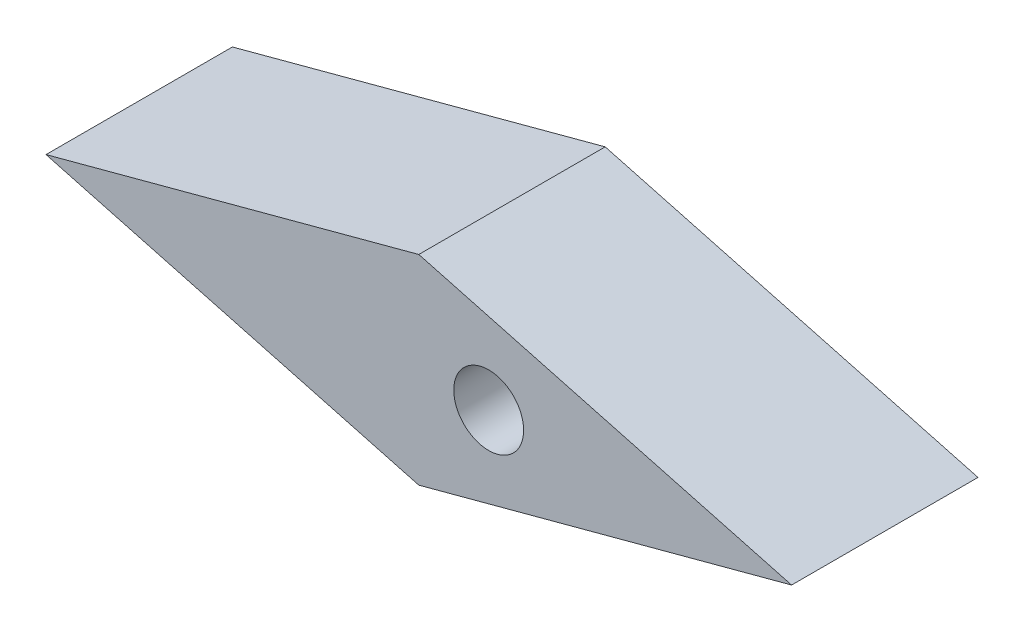
ISO-10303-21;
HEADER;
FILE_DESCRIPTION(('STEP AP214'),'2;1');
FILE_NAME('part.step','',(''),(''),'','','');
FILE_SCHEMA(('AUTOMOTIVE_DESIGN { 1 0 10303 214 1 1 1 1 }'));
ENDSEC;
DATA;
#1=APPLICATION_CONTEXT('core data for automotive mechanical design processes');
#2=APPLICATION_PROTOCOL_DEFINITION('international standard','automotive_design',2000,#1);
#3=PRODUCT_CONTEXT('',#1,'mechanical');
#4=PRODUCT('Part','Part','',(#3));
#5=PRODUCT_RELATED_PRODUCT_CATEGORY('part','',(#4));
#6=PRODUCT_DEFINITION_FORMATION('','',#4);
#7=PRODUCT_DEFINITION_CONTEXT('part definition',#1,'design');
#8=PRODUCT_DEFINITION('design','',#6,#7);
#9=PRODUCT_DEFINITION_SHAPE('','',#8);
#10=(LENGTH_UNIT() NAMED_UNIT(*) SI_UNIT(.MILLI.,.METRE.));
#11=(NAMED_UNIT(*) PLANE_ANGLE_UNIT() SI_UNIT($,.RADIAN.));
#12=(NAMED_UNIT(*) SI_UNIT($,.STERADIAN.) SOLID_ANGLE_UNIT());
#13=UNCERTAINTY_MEASURE_WITH_UNIT(LENGTH_MEASURE(1.E-05),#10,'distance_accuracy_value','');
#14=(GEOMETRIC_REPRESENTATION_CONTEXT(3) GLOBAL_UNCERTAINTY_ASSIGNED_CONTEXT((#13)) GLOBAL_UNIT_ASSIGNED_CONTEXT((#10,
#11,#12)) REPRESENTATION_CONTEXT('',''));
#15=CARTESIAN_POINT('',(0.,0.,0.));
#16=DIRECTION('',(0.,0.,1.));
#17=DIRECTION('',(1.,0.,0.));
#18=AXIS2_PLACEMENT_3D('',#15,#16,#17);
#19=CARTESIAN_POINT('',(3.,0.,8.));
#20=DIRECTION('',(0.,0.,-1.));
#21=DIRECTION('',(-1.,0.,0.));
#22=AXIS2_PLACEMENT_3D('',#19,#20,#21);
#23=CYLINDRICAL_SURFACE('',#22,1.5);
#24=CARTESIAN_POINT('',(3.,0.,8.));
#25=DIRECTION('',(0.,0.,-1.));
#26=DIRECTION('',(-1.,0.,0.));
#27=AXIS2_PLACEMENT_3D('',#24,#25,#26);
#28=CIRCLE('',#27,1.5);
#29=CARTESIAN_POINT('',(1.5,0.,8.));
#30=VERTEX_POINT('',#29);
#31=EDGE_CURVE('E105',#30,#30,#28,.T.);
#32=ORIENTED_EDGE('',*,*,#31,.F.);
#33=EDGE_LOOP('',(#32));
#34=FACE_BOUND('',#33,.T.);
#35=CARTESIAN_POINT('',(3.,0.,3.));
#36=DIRECTION('',(0.,0.,-1.));
#37=DIRECTION('',(-1.,0.,0.));
#38=AXIS2_PLACEMENT_3D('',#35,#36,#37);
#39=CIRCLE('',#38,1.5);
#40=CARTESIAN_POINT('',(1.5,0.,3.));
#41=VERTEX_POINT('',#40);
#42=EDGE_CURVE('E40',#41,#41,#39,.F.);
#43=ORIENTED_EDGE('',*,*,#42,.F.);
#44=EDGE_LOOP('',(#43));
#45=FACE_BOUND('',#44,.T.);
#46=ADVANCED_FACE('F36',(#34,#45),#23,.F.);
#47=CARTESIAN_POINT('',(0.,-4.28718707889784,8.));
#48=DIRECTION('',(0.258819045102514,0.96592582628907,0.));
#49=DIRECTION('',(-0.96592582628907,0.258819045102514,0.));
#50=AXIS2_PLACEMENT_3D('',#47,#48,#49);
#51=PLANE('',#50);
#52=DIRECTION('',(0.96592582628907,-0.258819045102514,0.));
#53=VECTOR('',#52,1.);
#54=CARTESIAN_POINT('',(0.,-4.28718707889784,0.));
#55=LINE('',#54,#53);
#56=CARTESIAN_POINT('',(-16.,0.,0.));
#57=VERTEX_POINT('',#56);
#58=CARTESIAN_POINT('',(0.,-4.28718707889784,0.));
#59=VERTEX_POINT('',#58);
#60=EDGE_CURVE('E102',#57,#59,#55,.T.);
#61=ORIENTED_EDGE('',*,*,#60,.T.);
#62=DIRECTION('',(0.,0.,-1.));
#63=VECTOR('',#62,1.);
#64=CARTESIAN_POINT('',(0.,-4.28718707889784,8.));
#65=LINE('',#64,#63);
#66=CARTESIAN_POINT('',(0.,-4.28718707889784,8.));
#67=VERTEX_POINT('',#66);
#68=EDGE_CURVE('E11',#67,#59,#65,.T.);
#69=ORIENTED_EDGE('',*,*,#68,.F.);
#70=DIRECTION('',(0.96592582628907,-0.258819045102514,0.));
#71=VECTOR('',#70,1.);
#72=CARTESIAN_POINT('',(0.,-4.28718707889784,8.));
#73=LINE('',#72,#71);
#74=CARTESIAN_POINT('',(-16.,0.,8.));
#75=VERTEX_POINT('',#74);
#76=EDGE_CURVE('E89',#75,#67,#73,.T.);
#77=ORIENTED_EDGE('',*,*,#76,.F.);
#78=DIRECTION('',(0.,0.,-1.));
#79=VECTOR('',#78,1.);
#80=CARTESIAN_POINT('',(-16.,0.,8.));
#81=LINE('',#80,#79);
#82=EDGE_CURVE('E98',#75,#57,#81,.T.);
#83=ORIENTED_EDGE('',*,*,#82,.T.);
#84=EDGE_LOOP('',(#61,#69,#77,#83));
#85=FACE_BOUND('',#84,.T.);
#86=ADVANCED_FACE('F38',(#85),#51,.F.);
#87=CARTESIAN_POINT('',(16.,0.,8.));
#88=DIRECTION('',(-0.258819045102514,0.96592582628907,0.));
#89=DIRECTION('',(-0.96592582628907,-0.258819045102514,0.));
#90=AXIS2_PLACEMENT_3D('',#87,#88,#89);
#91=PLANE('',#90);
#92=DIRECTION('',(0.96592582628907,0.258819045102514,0.));
#93=VECTOR('',#92,1.);
#94=CARTESIAN_POINT('',(16.,0.,0.));
#95=LINE('',#94,#93);
#96=CARTESIAN_POINT('',(16.,0.,0.));
#97=VERTEX_POINT('',#96);
#98=EDGE_CURVE('E93',#59,#97,#95,.T.);
#99=ORIENTED_EDGE('',*,*,#98,.T.);
#100=DIRECTION('',(0.,0.,-1.));
#101=VECTOR('',#100,1.);
#102=CARTESIAN_POINT('',(16.,0.,8.));
#103=LINE('',#102,#101);
#104=CARTESIAN_POINT('',(16.,0.,8.));
#105=VERTEX_POINT('',#104);
#106=EDGE_CURVE('E46',#105,#97,#103,.T.);
#107=ORIENTED_EDGE('',*,*,#106,.F.);
#108=DIRECTION('',(0.96592582628907,0.258819045102514,0.));
#109=VECTOR('',#108,1.);
#110=CARTESIAN_POINT('',(16.,0.,8.));
#111=LINE('',#110,#109);
#112=EDGE_CURVE('E84',#67,#105,#111,.T.);
#113=ORIENTED_EDGE('',*,*,#112,.F.);
#114=ORIENTED_EDGE('',*,*,#68,.T.);
#115=EDGE_LOOP('',(#99,#107,#113,#114));
#116=FACE_BOUND('',#115,.T.);
#117=ADVANCED_FACE('F92',(#116),#91,.F.);
#118=CARTESIAN_POINT('',(0.,4.28718707889798,8.));
#119=DIRECTION('',(-0.258819045102522,-0.965925826289068,0.));
#120=DIRECTION('',(0.965925826289068,-0.258819045102522,0.));
#121=AXIS2_PLACEMENT_3D('',#118,#119,#120);
#122=PLANE('',#121);
#123=DIRECTION('',(-0.965925826289068,0.258819045102522,0.));
#124=VECTOR('',#123,1.);
#125=CARTESIAN_POINT('',(0.,4.28718707889798,0.));
#126=LINE('',#125,#124);
#127=CARTESIAN_POINT('',(0.,4.28718707889798,0.));
#128=VERTEX_POINT('',#127);
#129=EDGE_CURVE('E71',#97,#128,#126,.T.);
#130=ORIENTED_EDGE('',*,*,#129,.T.);
#131=DIRECTION('',(0.,0.,-1.));
#132=VECTOR('',#131,1.);
#133=CARTESIAN_POINT('',(0.,4.28718707889798,8.));
#134=LINE('',#133,#132);
#135=CARTESIAN_POINT('',(0.,4.28718707889798,8.));
#136=VERTEX_POINT('',#135);
#137=EDGE_CURVE('E94',#136,#128,#134,.T.);
#138=ORIENTED_EDGE('',*,*,#137,.F.);
#139=DIRECTION('',(-0.965925826289068,0.258819045102522,0.));
#140=VECTOR('',#139,1.);
#141=CARTESIAN_POINT('',(0.,4.28718707889798,8.));
#142=LINE('',#141,#140);
#143=EDGE_CURVE('E87',#105,#136,#142,.T.);
#144=ORIENTED_EDGE('',*,*,#143,.F.);
#145=ORIENTED_EDGE('',*,*,#106,.T.);
#146=EDGE_LOOP('',(#130,#138,#144,#145));
#147=FACE_BOUND('',#146,.T.);
#148=ADVANCED_FACE('F96',(#147),#122,.F.);
#149=CARTESIAN_POINT('',(-16.,0.,8.));
#150=DIRECTION('',(0.258819045102522,-0.965925826289068,0.));
#151=DIRECTION('',(0.965925826289068,0.258819045102522,0.));
#152=AXIS2_PLACEMENT_3D('',#149,#150,#151);
#153=PLANE('',#152);
#154=DIRECTION('',(-0.965925826289068,-0.258819045102522,0.));
#155=VECTOR('',#154,1.);
#156=CARTESIAN_POINT('',(-16.,0.,0.));
#157=LINE('',#156,#155);
#158=EDGE_CURVE('E77',#128,#57,#157,.T.);
#159=ORIENTED_EDGE('',*,*,#158,.T.);
#160=ORIENTED_EDGE('',*,*,#82,.F.);
#161=DIRECTION('',(-0.965925826289068,-0.258819045102522,0.));
#162=VECTOR('',#161,1.);
#163=CARTESIAN_POINT('',(-16.,0.,8.));
#164=LINE('',#163,#162);
#165=EDGE_CURVE('E54',#136,#75,#164,.T.);
#166=ORIENTED_EDGE('',*,*,#165,.F.);
#167=ORIENTED_EDGE('',*,*,#137,.T.);
#168=EDGE_LOOP('',(#159,#160,#166,#167));
#169=FACE_BOUND('',#168,.T.);
#170=ADVANCED_FACE('F110',(#169),#153,.F.);
#171=CARTESIAN_POINT('',(0.,0.,8.));
#172=DIRECTION('',(0.,0.,-1.));
#173=DIRECTION('',(-1.,0.,0.));
#174=AXIS2_PLACEMENT_3D('',#171,#172,#173);
#175=PLANE('',#174);
#176=ORIENTED_EDGE('',*,*,#31,.T.);
#177=EDGE_LOOP('',(#176));
#178=FACE_BOUND('',#177,.T.);
#179=ORIENTED_EDGE('',*,*,#76,.T.);
#180=ORIENTED_EDGE('',*,*,#112,.T.);
#181=ORIENTED_EDGE('',*,*,#143,.T.);
#182=ORIENTED_EDGE('',*,*,#165,.T.);
#183=EDGE_LOOP('',(#179,#180,#181,#182));
#184=FACE_BOUND('',#183,.T.);
#185=ADVANCED_FACE('F85',(#178,#184),#175,.F.);
#186=CARTESIAN_POINT('',(0.,0.,0.));
#187=DIRECTION('',(0.,0.,-1.));
#188=DIRECTION('',(-1.,0.,0.));
#189=AXIS2_PLACEMENT_3D('',#186,#187,#188);
#190=PLANE('',#189);
#191=CARTESIAN_POINT('',(3.,0.,0.));
#192=DIRECTION('',(0.,0.,-1.));
#193=DIRECTION('',(-1.,0.,0.));
#194=AXIS2_PLACEMENT_3D('',#191,#192,#193);
#195=CIRCLE('',#194,2.5);
#196=CARTESIAN_POINT('',(0.500000000000001,0.,0.));
#197=VERTEX_POINT('',#196);
#198=EDGE_CURVE('E118',#197,#197,#195,.T.);
#199=ORIENTED_EDGE('',*,*,#198,.F.);
#200=EDGE_LOOP('',(#199));
#201=FACE_BOUND('',#200,.T.);
#202=ORIENTED_EDGE('',*,*,#60,.F.);
#203=ORIENTED_EDGE('',*,*,#158,.F.);
#204=ORIENTED_EDGE('',*,*,#129,.F.);
#205=ORIENTED_EDGE('',*,*,#98,.F.);
#206=EDGE_LOOP('',(#202,#203,#204,#205));
#207=FACE_BOUND('',#206,.T.);
#208=ADVANCED_FACE('F113',(#201,#207),#190,.T.);
#209=CARTESIAN_POINT('',(3.,0.,3.));
#210=DIRECTION('',(0.,0.,-1.));
#211=DIRECTION('',(-1.,0.,0.));
#212=AXIS2_PLACEMENT_3D('',#209,#210,#211);
#213=PLANE('',#212);
#214=CARTESIAN_POINT('',(3.,0.,3.));
#215=DIRECTION('',(0.,0.,-1.));
#216=DIRECTION('',(-1.,0.,0.));
#217=AXIS2_PLACEMENT_3D('',#214,#215,#216);
#218=CIRCLE('',#217,2.5);
#219=CARTESIAN_POINT('',(0.500000000000001,0.,3.));
#220=VERTEX_POINT('',#219);
#221=EDGE_CURVE('E121',#220,#220,#218,.T.);
#222=ORIENTED_EDGE('',*,*,#221,.T.);
#223=EDGE_LOOP('',(#222));
#224=FACE_BOUND('',#223,.T.);
#225=ORIENTED_EDGE('',*,*,#42,.T.);
#226=EDGE_LOOP('',(#225));
#227=FACE_BOUND('',#226,.T.);
#228=ADVANCED_FACE('F128',(#224,#227),#213,.T.);
#229=CARTESIAN_POINT('',(3.,0.,3.));
#230=DIRECTION('',(0.,0.,-1.));
#231=DIRECTION('',(-1.,0.,0.));
#232=AXIS2_PLACEMENT_3D('',#229,#230,#231);
#233=CYLINDRICAL_SURFACE('',#232,2.5);
#234=ORIENTED_EDGE('',*,*,#221,.F.);
#235=EDGE_LOOP('',(#234));
#236=FACE_BOUND('',#235,.T.);
#237=ORIENTED_EDGE('',*,*,#198,.T.);
#238=EDGE_LOOP('',(#237));
#239=FACE_BOUND('',#238,.T.);
#240=ADVANCED_FACE('F139',(#236,#239),#233,.F.);
#241=CLOSED_SHELL('',(#46,#86,#117,#148,#170,#185,#208,#228,#240));
#242=MANIFOLD_SOLID_BREP('B2',#241);
#243=ADVANCED_BREP_SHAPE_REPRESENTATION('',(#18,#242),#14);
#244=SHAPE_DEFINITION_REPRESENTATION(#9,#243);
ENDSEC;
END-ISO-10303-21;
